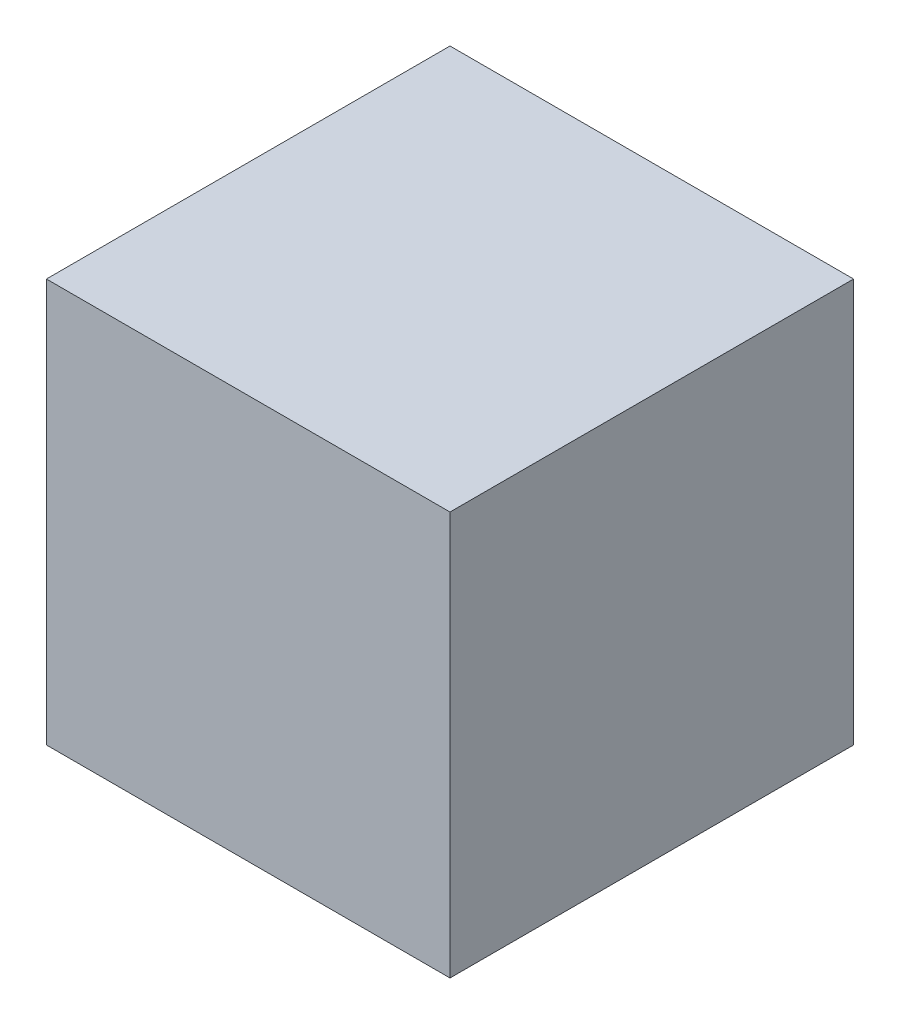
ISO-10303-21;
HEADER;
FILE_DESCRIPTION(('STEP AP214'),'2;1');
FILE_NAME('part.step','',(''),(''),'','','');
FILE_SCHEMA(('AUTOMOTIVE_DESIGN { 1 0 10303 214 1 1 1 1 }'));
ENDSEC;
DATA;
#1=APPLICATION_CONTEXT('core data for automotive mechanical design processes');
#2=APPLICATION_PROTOCOL_DEFINITION('international standard','automotive_design',2000,#1);
#3=PRODUCT_CONTEXT('',#1,'mechanical');
#4=PRODUCT('Part','Part','',(#3));
#5=PRODUCT_RELATED_PRODUCT_CATEGORY('part','',(#4));
#6=PRODUCT_DEFINITION_FORMATION('','',#4);
#7=PRODUCT_DEFINITION_CONTEXT('part definition',#1,'design');
#8=PRODUCT_DEFINITION('design','',#6,#7);
#9=PRODUCT_DEFINITION_SHAPE('','',#8);
#10=(LENGTH_UNIT() NAMED_UNIT(*) SI_UNIT(.MILLI.,.METRE.));
#11=(NAMED_UNIT(*) PLANE_ANGLE_UNIT() SI_UNIT($,.RADIAN.));
#12=(NAMED_UNIT(*) SI_UNIT($,.STERADIAN.) SOLID_ANGLE_UNIT());
#13=UNCERTAINTY_MEASURE_WITH_UNIT(LENGTH_MEASURE(1.E-05),#10,'distance_accuracy_value','');
#14=(GEOMETRIC_REPRESENTATION_CONTEXT(3) GLOBAL_UNCERTAINTY_ASSIGNED_CONTEXT((#13)) GLOBAL_UNIT_ASSIGNED_CONTEXT((#10,
#11,#12)) REPRESENTATION_CONTEXT('',''));
#15=CARTESIAN_POINT('',(0.,0.,0.));
#16=DIRECTION('',(0.,0.,1.));
#17=DIRECTION('',(1.,0.,0.));
#18=AXIS2_PLACEMENT_3D('',#15,#16,#17);
#19=CARTESIAN_POINT('',(19.5,19.5,39.));
#20=DIRECTION('',(-1.,0.,0.));
#21=DIRECTION('',(0.,-1.,0.));
#22=AXIS2_PLACEMENT_3D('',#19,#20,#21);
#23=PLANE('',#22);
#24=DIRECTION('',(0.,1.,0.));
#25=VECTOR('',#24,1.);
#26=CARTESIAN_POINT('',(19.5,19.5,0.));
#27=LINE('',#26,#25);
#28=CARTESIAN_POINT('',(19.5,-19.5,0.));
#29=VERTEX_POINT('',#28);
#30=CARTESIAN_POINT('',(19.5,19.5,0.));
#31=VERTEX_POINT('',#30);
#32=EDGE_CURVE('E107',#29,#31,#27,.T.);
#33=ORIENTED_EDGE('',*,*,#32,.T.);
#34=DIRECTION('',(0.,0.,-1.));
#35=VECTOR('',#34,1.);
#36=CARTESIAN_POINT('',(19.5,19.5,39.));
#37=LINE('',#36,#35);
#38=CARTESIAN_POINT('',(19.5,19.5,39.));
#39=VERTEX_POINT('',#38);
#40=EDGE_CURVE('E11',#39,#31,#37,.T.);
#41=ORIENTED_EDGE('',*,*,#40,.F.);
#42=DIRECTION('',(0.,1.,0.));
#43=VECTOR('',#42,1.);
#44=CARTESIAN_POINT('',(19.5,19.5,39.));
#45=LINE('',#44,#43);
#46=CARTESIAN_POINT('',(19.5,-19.5,39.));
#47=VERTEX_POINT('',#46);
#48=EDGE_CURVE('E91',#47,#39,#45,.T.);
#49=ORIENTED_EDGE('',*,*,#48,.F.);
#50=DIRECTION('',(0.,0.,-1.));
#51=VECTOR('',#50,1.);
#52=CARTESIAN_POINT('',(19.5,-19.5,39.));
#53=LINE('',#52,#51);
#54=EDGE_CURVE('E103',#47,#29,#53,.T.);
#55=ORIENTED_EDGE('',*,*,#54,.T.);
#56=EDGE_LOOP('',(#33,#41,#49,#55));
#57=FACE_BOUND('',#56,.T.);
#58=ADVANCED_FACE('F39',(#57),#23,.F.);
#59=CARTESIAN_POINT('',(-19.5,19.5,39.));
#60=DIRECTION('',(0.,-1.,0.));
#61=DIRECTION('',(1.,0.,0.));
#62=AXIS2_PLACEMENT_3D('',#59,#60,#61);
#63=PLANE('',#62);
#64=DIRECTION('',(-1.,0.,0.));
#65=VECTOR('',#64,1.);
#66=CARTESIAN_POINT('',(-19.5,19.5,0.));
#67=LINE('',#66,#65);
#68=CARTESIAN_POINT('',(-19.5,19.5,0.));
#69=VERTEX_POINT('',#68);
#70=EDGE_CURVE('E96',#31,#69,#67,.T.);
#71=ORIENTED_EDGE('',*,*,#70,.T.);
#72=DIRECTION('',(0.,0.,-1.));
#73=VECTOR('',#72,1.);
#74=CARTESIAN_POINT('',(-19.5,19.5,39.));
#75=LINE('',#74,#73);
#76=CARTESIAN_POINT('',(-19.5,19.5,39.));
#77=VERTEX_POINT('',#76);
#78=EDGE_CURVE('E48',#77,#69,#75,.T.);
#79=ORIENTED_EDGE('',*,*,#78,.F.);
#80=DIRECTION('',(-1.,0.,0.));
#81=VECTOR('',#80,1.);
#82=CARTESIAN_POINT('',(-19.5,19.5,39.));
#83=LINE('',#82,#81);
#84=EDGE_CURVE('E86',#39,#77,#83,.T.);
#85=ORIENTED_EDGE('',*,*,#84,.F.);
#86=ORIENTED_EDGE('',*,*,#40,.T.);
#87=EDGE_LOOP('',(#71,#79,#85,#86));
#88=FACE_BOUND('',#87,.T.);
#89=ADVANCED_FACE('F95',(#88),#63,.F.);
#90=CARTESIAN_POINT('',(-19.5,19.5,39.));
#91=DIRECTION('',(1.,0.,0.));
#92=DIRECTION('',(0.,1.,0.));
#93=AXIS2_PLACEMENT_3D('',#90,#91,#92);
#94=PLANE('',#93);
#95=DIRECTION('',(0.,-1.,0.));
#96=VECTOR('',#95,1.);
#97=CARTESIAN_POINT('',(-19.5,19.5,0.));
#98=LINE('',#97,#96);
#99=CARTESIAN_POINT('',(-19.5,-19.5,0.));
#100=VERTEX_POINT('',#99);
#101=EDGE_CURVE('E73',#69,#100,#98,.T.);
#102=ORIENTED_EDGE('',*,*,#101,.T.);
#103=DIRECTION('',(0.,0.,-1.));
#104=VECTOR('',#103,1.);
#105=CARTESIAN_POINT('',(-19.5,-19.5,39.));
#106=LINE('',#105,#104);
#107=CARTESIAN_POINT('',(-19.5,-19.5,39.));
#108=VERTEX_POINT('',#107);
#109=EDGE_CURVE('E98',#108,#100,#106,.T.);
#110=ORIENTED_EDGE('',*,*,#109,.F.);
#111=DIRECTION('',(0.,-1.,0.));
#112=VECTOR('',#111,1.);
#113=CARTESIAN_POINT('',(-19.5,19.5,39.));
#114=LINE('',#113,#112);
#115=EDGE_CURVE('E89',#77,#108,#114,.T.);
#116=ORIENTED_EDGE('',*,*,#115,.F.);
#117=ORIENTED_EDGE('',*,*,#78,.T.);
#118=EDGE_LOOP('',(#102,#110,#116,#117));
#119=FACE_BOUND('',#118,.T.);
#120=ADVANCED_FACE('F99',(#119),#94,.F.);
#121=CARTESIAN_POINT('',(-19.5,-19.5,39.));
#122=DIRECTION('',(0.,1.,0.));
#123=DIRECTION('',(0.,0.,1.));
#124=AXIS2_PLACEMENT_3D('',#121,#122,#123);
#125=PLANE('',#124);
#126=DIRECTION('',(1.,0.,0.));
#127=VECTOR('',#126,1.);
#128=CARTESIAN_POINT('',(-19.5,-19.5,0.));
#129=LINE('',#128,#127);
#130=EDGE_CURVE('E79',#100,#29,#129,.T.);
#131=ORIENTED_EDGE('',*,*,#130,.T.);
#132=ORIENTED_EDGE('',*,*,#54,.F.);
#133=DIRECTION('',(1.,0.,0.));
#134=VECTOR('',#133,1.);
#135=CARTESIAN_POINT('',(-19.5,-19.5,39.));
#136=LINE('',#135,#134);
#137=EDGE_CURVE('E56',#108,#47,#136,.T.);
#138=ORIENTED_EDGE('',*,*,#137,.F.);
#139=ORIENTED_EDGE('',*,*,#109,.T.);
#140=EDGE_LOOP('',(#131,#132,#138,#139));
#141=FACE_BOUND('',#140,.T.);
#142=ADVANCED_FACE('F120',(#141),#125,.F.);
#143=CARTESIAN_POINT('',(0.,0.,39.));
#144=DIRECTION('',(0.,0.,1.));
#145=DIRECTION('',(1.,0.,0.));
#146=AXIS2_PLACEMENT_3D('',#143,#144,#145);
#147=PLANE('',#146);
#148=ORIENTED_EDGE('',*,*,#48,.T.);
#149=ORIENTED_EDGE('',*,*,#84,.T.);
#150=ORIENTED_EDGE('',*,*,#115,.T.);
#151=ORIENTED_EDGE('',*,*,#137,.T.);
#152=EDGE_LOOP('',(#148,#149,#150,#151));
#153=FACE_BOUND('',#152,.T.);
#154=ADVANCED_FACE('F87',(#153),#147,.T.);
#155=CARTESIAN_POINT('',(0.,0.,0.));
#156=DIRECTION('',(0.,0.,1.));
#157=DIRECTION('',(1.,0.,0.));
#158=AXIS2_PLACEMENT_3D('',#155,#156,#157);
#159=PLANE('',#158);
#160=ORIENTED_EDGE('',*,*,#32,.F.);
#161=ORIENTED_EDGE('',*,*,#130,.F.);
#162=ORIENTED_EDGE('',*,*,#101,.F.);
#163=ORIENTED_EDGE('',*,*,#70,.F.);
#164=EDGE_LOOP('',(#160,#161,#162,#163));
#165=FACE_BOUND('',#164,.T.);
#166=ADVANCED_FACE('F123',(#165),#159,.F.);
#167=CLOSED_SHELL('',(#58,#89,#120,#142,#154,#166));
#168=MANIFOLD_SOLID_BREP('B2',#167);
#169=ADVANCED_BREP_SHAPE_REPRESENTATION('',(#18,#168),#14);
#170=SHAPE_DEFINITION_REPRESENTATION(#9,#169);
ENDSEC;
END-ISO-10303-21;
